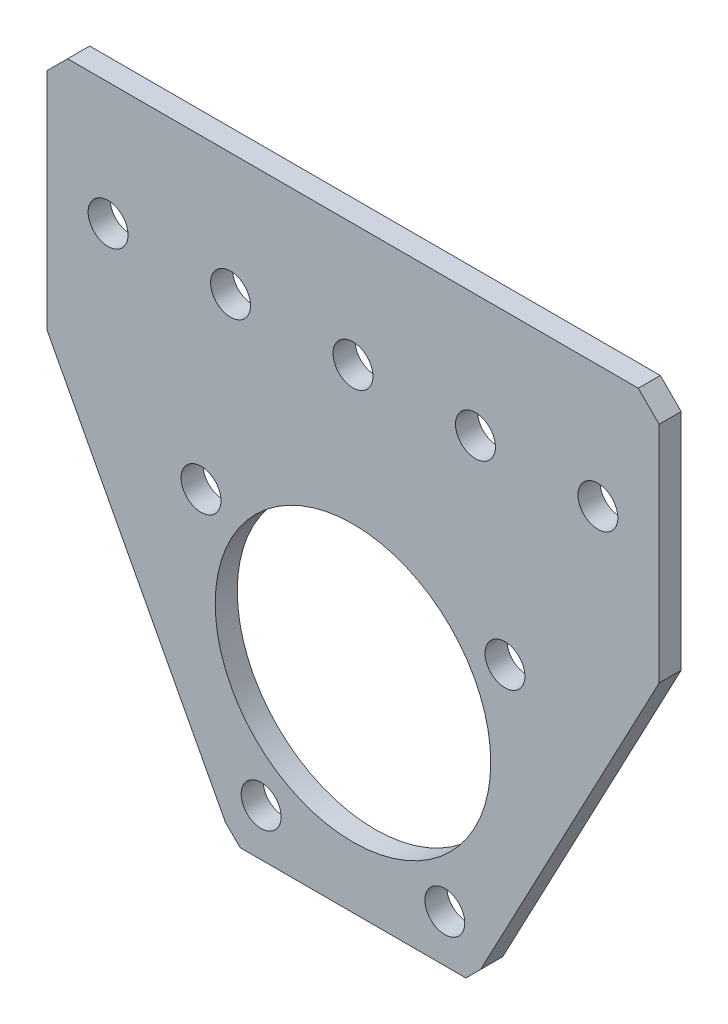
ISO-10303-21;
HEADER;
FILE_DESCRIPTION(('STEP AP214'),'2;1');
FILE_NAME('part.step','',(''),(''),'','','');
FILE_SCHEMA(('AUTOMOTIVE_DESIGN { 1 0 10303 214 1 1 1 1 }'));
ENDSEC;
DATA;
#1=APPLICATION_CONTEXT('core data for automotive mechanical design processes');
#2=APPLICATION_PROTOCOL_DEFINITION('international standard','automotive_design',2000,#1);
#3=PRODUCT_CONTEXT('',#1,'mechanical');
#4=PRODUCT('Part','Part','',(#3));
#5=PRODUCT_RELATED_PRODUCT_CATEGORY('part','',(#4));
#6=PRODUCT_DEFINITION_FORMATION('','',#4);
#7=PRODUCT_DEFINITION_CONTEXT('part definition',#1,'design');
#8=PRODUCT_DEFINITION('design','',#6,#7);
#9=PRODUCT_DEFINITION_SHAPE('','',#8);
#10=(LENGTH_UNIT() NAMED_UNIT(*) SI_UNIT(.MILLI.,.METRE.));
#11=(NAMED_UNIT(*) PLANE_ANGLE_UNIT() SI_UNIT($,.RADIAN.));
#12=(NAMED_UNIT(*) SI_UNIT($,.STERADIAN.) SOLID_ANGLE_UNIT());
#13=UNCERTAINTY_MEASURE_WITH_UNIT(LENGTH_MEASURE(1.E-05),#10,'distance_accuracy_value','');
#14=(GEOMETRIC_REPRESENTATION_CONTEXT(3) GLOBAL_UNCERTAINTY_ASSIGNED_CONTEXT((#13)) GLOBAL_UNIT_ASSIGNED_CONTEXT((#10,
#11,#12)) REPRESENTATION_CONTEXT('',''));
#15=CARTESIAN_POINT('',(0.,0.,0.));
#16=DIRECTION('',(0.,0.,1.));
#17=DIRECTION('',(1.,0.,0.));
#18=AXIS2_PLACEMENT_3D('',#15,#16,#17);
#19=CARTESIAN_POINT('',(-29.591,41.275,2.286));
#20=DIRECTION('',(0.,1.,0.));
#21=DIRECTION('',(-1.,0.,0.));
#22=AXIS2_PLACEMENT_3D('',#19,#20,#21);
#23=PLANE('',#22);
#24=DIRECTION('',(1.,0.,0.));
#25=VECTOR('',#24,1.);
#26=CARTESIAN_POINT('',(-29.591,41.275,0.));
#27=LINE('',#26,#25);
#28=CARTESIAN_POINT('',(-29.591,41.275,0.));
#29=VERTEX_POINT('',#28);
#30=CARTESIAN_POINT('',(29.591,41.275,0.));
#31=VERTEX_POINT('',#30);
#32=EDGE_CURVE('E142',#29,#31,#27,.T.);
#33=ORIENTED_EDGE('',*,*,#32,.F.);
#34=DIRECTION('',(0.,0.,-1.));
#35=VECTOR('',#34,1.);
#36=CARTESIAN_POINT('',(-29.591,41.275,2.286));
#37=LINE('',#36,#35);
#38=CARTESIAN_POINT('',(-29.591,41.275,2.286));
#39=VERTEX_POINT('',#38);
#40=EDGE_CURVE('E11',#39,#29,#37,.T.);
#41=ORIENTED_EDGE('',*,*,#40,.F.);
#42=DIRECTION('',(1.,0.,0.));
#43=VECTOR('',#42,1.);
#44=CARTESIAN_POINT('',(-29.591,41.275,2.286));
#45=LINE('',#44,#43);
#46=CARTESIAN_POINT('',(29.591,41.275,2.286));
#47=VERTEX_POINT('',#46);
#48=EDGE_CURVE('E169',#39,#47,#45,.T.);
#49=ORIENTED_EDGE('',*,*,#48,.T.);
#50=DIRECTION('',(0.,0.,-1.));
#51=VECTOR('',#50,1.);
#52=CARTESIAN_POINT('',(29.591,41.275,2.286));
#53=LINE('',#52,#51);
#54=EDGE_CURVE('E36',#47,#31,#53,.T.);
#55=ORIENTED_EDGE('',*,*,#54,.T.);
#56=EDGE_LOOP('',(#33,#41,#49,#55));
#57=FACE_BOUND('',#56,.T.);
#58=ADVANCED_FACE('F33',(#57),#23,.T.);
#59=CARTESIAN_POINT('',(-31.75,39.116,2.286));
#60=DIRECTION('',(-0.707106781186545,0.70710678118655,0.));
#61=DIRECTION('',(-0.70710678118655,-0.707106781186545,0.));
#62=AXIS2_PLACEMENT_3D('',#59,#60,#61);
#63=PLANE('',#62);
#64=DIRECTION('',(0.70710678118655,0.707106781186545,0.));
#65=VECTOR('',#64,1.);
#66=CARTESIAN_POINT('',(-31.75,39.116,0.));
#67=LINE('',#66,#65);
#68=CARTESIAN_POINT('',(-31.75,39.116,0.));
#69=VERTEX_POINT('',#68);
#70=EDGE_CURVE('E167',#69,#29,#67,.T.);
#71=ORIENTED_EDGE('',*,*,#70,.F.);
#72=DIRECTION('',(0.,0.,-1.));
#73=VECTOR('',#72,1.);
#74=CARTESIAN_POINT('',(-31.75,39.116,2.286));
#75=LINE('',#74,#73);
#76=CARTESIAN_POINT('',(-31.75,39.116,2.286));
#77=VERTEX_POINT('',#76);
#78=EDGE_CURVE('E42',#77,#69,#75,.T.);
#79=ORIENTED_EDGE('',*,*,#78,.F.);
#80=DIRECTION('',(0.70710678118655,0.707106781186545,0.));
#81=VECTOR('',#80,1.);
#82=CARTESIAN_POINT('',(-31.75,39.116,2.286));
#83=LINE('',#82,#81);
#84=EDGE_CURVE('E132',#77,#39,#83,.T.);
#85=ORIENTED_EDGE('',*,*,#84,.T.);
#86=ORIENTED_EDGE('',*,*,#40,.T.);
#87=EDGE_LOOP('',(#71,#79,#85,#86));
#88=FACE_BOUND('',#87,.T.);
#89=ADVANCED_FACE('F185',(#88),#63,.T.);
#90=CARTESIAN_POINT('',(-31.75,15.875,2.286));
#91=DIRECTION('',(-1.,0.,0.));
#92=DIRECTION('',(0.,-1.,0.));
#93=AXIS2_PLACEMENT_3D('',#90,#91,#92);
#94=PLANE('',#93);
#95=DIRECTION('',(0.,1.,0.));
#96=VECTOR('',#95,1.);
#97=CARTESIAN_POINT('',(-31.75,15.875,0.));
#98=LINE('',#97,#96);
#99=CARTESIAN_POINT('',(-31.75,15.875,0.));
#100=VERTEX_POINT('',#99);
#101=EDGE_CURVE('E119',#100,#69,#98,.T.);
#102=ORIENTED_EDGE('',*,*,#101,.F.);
#103=DIRECTION('',(0.,0.,-1.));
#104=VECTOR('',#103,1.);
#105=CARTESIAN_POINT('',(-31.75,15.875,2.286));
#106=LINE('',#105,#104);
#107=CARTESIAN_POINT('',(-31.75,15.875,2.286));
#108=VERTEX_POINT('',#107);
#109=EDGE_CURVE('E114',#108,#100,#106,.T.);
#110=ORIENTED_EDGE('',*,*,#109,.F.);
#111=DIRECTION('',(0.,1.,0.));
#112=VECTOR('',#111,1.);
#113=CARTESIAN_POINT('',(-31.75,15.875,2.286));
#114=LINE('',#113,#112);
#115=EDGE_CURVE('E117',#108,#77,#114,.T.);
#116=ORIENTED_EDGE('',*,*,#115,.T.);
#117=ORIENTED_EDGE('',*,*,#78,.T.);
#118=EDGE_LOOP('',(#102,#110,#116,#117));
#119=FACE_BOUND('',#118,.T.);
#120=ADVANCED_FACE('F116',(#119),#94,.T.);
#121=CARTESIAN_POINT('',(-13.2357534010395,-19.1108564594182,2.286));
#122=DIRECTION('',(-0.883868107973205,-0.46773621594641,0.));
#123=DIRECTION('',(0.46773621594641,-0.883868107973205,0.));
#124=AXIS2_PLACEMENT_3D('',#121,#122,#123);
#125=PLANE('',#124);
#126=DIRECTION('',(-0.46773621594641,0.883868107973205,0.));
#127=VECTOR('',#126,1.);
#128=CARTESIAN_POINT('',(-13.2357534010395,-19.1108564594182,0.));
#129=LINE('',#128,#127);
#130=CARTESIAN_POINT('',(-13.2357534010395,-19.1108564594182,0.));
#131=VERTEX_POINT('',#130);
#132=EDGE_CURVE('E164',#131,#100,#129,.T.);
#133=ORIENTED_EDGE('',*,*,#132,.F.);
#134=DIRECTION('',(0.,0.,-1.));
#135=VECTOR('',#134,1.);
#136=CARTESIAN_POINT('',(-13.2357534010395,-19.1108564594182,2.286));
#137=LINE('',#136,#135);
#138=CARTESIAN_POINT('',(-13.2357534010395,-19.1108564594182,2.286));
#139=VERTEX_POINT('',#138);
#140=EDGE_CURVE('E124',#139,#131,#137,.T.);
#141=ORIENTED_EDGE('',*,*,#140,.F.);
#142=DIRECTION('',(-0.46773621594641,0.883868107973205,0.));
#143=VECTOR('',#142,1.);
#144=CARTESIAN_POINT('',(-13.2357534010395,-19.1108564594182,2.286));
#145=LINE('',#144,#143);
#146=EDGE_CURVE('E130',#139,#108,#145,.T.);
#147=ORIENTED_EDGE('',*,*,#146,.T.);
#148=ORIENTED_EDGE('',*,*,#109,.T.);
#149=EDGE_LOOP('',(#133,#141,#147,#148));
#150=FACE_BOUND('',#149,.T.);
#151=ADVANCED_FACE('F134',(#150),#125,.T.);
#152=CARTESIAN_POINT('',(-11.7091098604578,-20.6375,2.286));
#153=DIRECTION('',(-0.70710678118655,-0.707106781186545,0.));
#154=DIRECTION('',(0.707106781186545,-0.70710678118655,0.));
#155=AXIS2_PLACEMENT_3D('',#152,#153,#154);
#156=PLANE('',#155);
#157=DIRECTION('',(-0.707106781186545,0.70710678118655,0.));
#158=VECTOR('',#157,1.);
#159=CARTESIAN_POINT('',(-11.7091098604578,-20.6375,0.));
#160=LINE('',#159,#158);
#161=CARTESIAN_POINT('',(-11.7091098604578,-20.6375,0.));
#162=VERTEX_POINT('',#161);
#163=EDGE_CURVE('E161',#162,#131,#160,.T.);
#164=ORIENTED_EDGE('',*,*,#163,.F.);
#165=DIRECTION('',(0.,0.,-1.));
#166=VECTOR('',#165,1.);
#167=CARTESIAN_POINT('',(-11.7091098604578,-20.6375,2.286));
#168=LINE('',#167,#166);
#169=CARTESIAN_POINT('',(-11.7091098604578,-20.6375,2.286));
#170=VERTEX_POINT('',#169);
#171=EDGE_CURVE('E173',#170,#162,#168,.T.);
#172=ORIENTED_EDGE('',*,*,#171,.F.);
#173=DIRECTION('',(-0.707106781186545,0.70710678118655,0.));
#174=VECTOR('',#173,1.);
#175=CARTESIAN_POINT('',(-11.7091098604578,-20.6375,2.286));
#176=LINE('',#175,#174);
#177=EDGE_CURVE('E135',#170,#139,#176,.T.);
#178=ORIENTED_EDGE('',*,*,#177,.T.);
#179=ORIENTED_EDGE('',*,*,#140,.T.);
#180=EDGE_LOOP('',(#164,#172,#178,#179));
#181=FACE_BOUND('',#180,.T.);
#182=ADVANCED_FACE('F198',(#181),#156,.T.);
#183=CARTESIAN_POINT('',(11.7091098604577,-20.6375,2.286));
#184=DIRECTION('',(0.,-1.,0.));
#185=DIRECTION('',(1.,0.,0.));
#186=AXIS2_PLACEMENT_3D('',#183,#184,#185);
#187=PLANE('',#186);
#188=DIRECTION('',(-1.,0.,0.));
#189=VECTOR('',#188,1.);
#190=CARTESIAN_POINT('',(11.7091098604577,-20.6375,0.));
#191=LINE('',#190,#189);
#192=CARTESIAN_POINT('',(11.7091098604577,-20.6375,0.));
#193=VERTEX_POINT('',#192);
#194=EDGE_CURVE('E158',#193,#162,#191,.T.);
#195=ORIENTED_EDGE('',*,*,#194,.F.);
#196=DIRECTION('',(0.,0.,-1.));
#197=VECTOR('',#196,1.);
#198=CARTESIAN_POINT('',(11.7091098604577,-20.6375,2.286));
#199=LINE('',#198,#197);
#200=CARTESIAN_POINT('',(11.7091098604577,-20.6375,2.286));
#201=VERTEX_POINT('',#200);
#202=EDGE_CURVE('E175',#201,#193,#199,.T.);
#203=ORIENTED_EDGE('',*,*,#202,.F.);
#204=DIRECTION('',(-1.,0.,0.));
#205=VECTOR('',#204,1.);
#206=CARTESIAN_POINT('',(11.7091098604577,-20.6375,2.286));
#207=LINE('',#206,#205);
#208=EDGE_CURVE('E137',#201,#170,#207,.T.);
#209=ORIENTED_EDGE('',*,*,#208,.T.);
#210=ORIENTED_EDGE('',*,*,#171,.T.);
#211=EDGE_LOOP('',(#195,#203,#209,#210));
#212=FACE_BOUND('',#211,.T.);
#213=ADVANCED_FACE('F201',(#212),#187,.T.);
#214=CARTESIAN_POINT('',(13.2357534010395,-19.1108564594182,2.286));
#215=DIRECTION('',(0.707106781186546,-0.70710678118655,0.));
#216=DIRECTION('',(0.70710678118655,0.707106781186546,0.));
#217=AXIS2_PLACEMENT_3D('',#214,#215,#216);
#218=PLANE('',#217);
#219=DIRECTION('',(-0.707106781186549,-0.707106781186545,0.));
#220=VECTOR('',#219,1.);
#221=CARTESIAN_POINT('',(13.2357534010395,-19.1108564594182,0.));
#222=LINE('',#221,#220);
#223=CARTESIAN_POINT('',(13.2357534010395,-19.1108564594182,0.));
#224=VERTEX_POINT('',#223);
#225=EDGE_CURVE('E155',#224,#193,#222,.T.);
#226=ORIENTED_EDGE('',*,*,#225,.F.);
#227=DIRECTION('',(0.,0.,-1.));
#228=VECTOR('',#227,1.);
#229=CARTESIAN_POINT('',(13.2357534010395,-19.1108564594182,2.286));
#230=LINE('',#229,#228);
#231=CARTESIAN_POINT('',(13.2357534010395,-19.1108564594182,2.286));
#232=VERTEX_POINT('',#231);
#233=EDGE_CURVE('E177',#232,#224,#230,.T.);
#234=ORIENTED_EDGE('',*,*,#233,.F.);
#235=DIRECTION('',(-0.707106781186549,-0.707106781186545,0.));
#236=VECTOR('',#235,1.);
#237=CARTESIAN_POINT('',(13.2357534010395,-19.1108564594182,2.286));
#238=LINE('',#237,#236);
#239=EDGE_CURVE('E341',#232,#201,#238,.T.);
#240=ORIENTED_EDGE('',*,*,#239,.T.);
#241=ORIENTED_EDGE('',*,*,#202,.T.);
#242=EDGE_LOOP('',(#226,#234,#240,#241));
#243=FACE_BOUND('',#242,.T.);
#244=ADVANCED_FACE('F205',(#243),#218,.T.);
#245=CARTESIAN_POINT('',(31.75,15.875,2.286));
#246=DIRECTION('',(0.883868107973205,-0.46773621594641,0.));
#247=DIRECTION('',(0.46773621594641,0.883868107973205,0.));
#248=AXIS2_PLACEMENT_3D('',#245,#246,#247);
#249=PLANE('',#248);
#250=DIRECTION('',(-0.46773621594641,-0.883868107973205,0.));
#251=VECTOR('',#250,1.);
#252=CARTESIAN_POINT('',(31.75,15.875,0.));
#253=LINE('',#252,#251);
#254=CARTESIAN_POINT('',(31.75,15.875,0.));
#255=VERTEX_POINT('',#254);
#256=EDGE_CURVE('E152',#255,#224,#253,.T.);
#257=ORIENTED_EDGE('',*,*,#256,.F.);
#258=DIRECTION('',(0.,0.,-1.));
#259=VECTOR('',#258,1.);
#260=CARTESIAN_POINT('',(31.75,15.875,2.286));
#261=LINE('',#260,#259);
#262=CARTESIAN_POINT('',(31.75,15.875,2.286));
#263=VERTEX_POINT('',#262);
#264=EDGE_CURVE('E179',#263,#255,#261,.T.);
#265=ORIENTED_EDGE('',*,*,#264,.F.);
#266=DIRECTION('',(-0.46773621594641,-0.883868107973205,0.));
#267=VECTOR('',#266,1.);
#268=CARTESIAN_POINT('',(31.75,15.875,2.286));
#269=LINE('',#268,#267);
#270=EDGE_CURVE('E338',#263,#232,#269,.T.);
#271=ORIENTED_EDGE('',*,*,#270,.T.);
#272=ORIENTED_EDGE('',*,*,#233,.T.);
#273=EDGE_LOOP('',(#257,#265,#271,#272));
#274=FACE_BOUND('',#273,.T.);
#275=ADVANCED_FACE('F209',(#274),#249,.T.);
#276=CARTESIAN_POINT('',(31.75,39.116,2.286));
#277=DIRECTION('',(1.,0.,0.));
#278=DIRECTION('',(0.,0.,-1.));
#279=AXIS2_PLACEMENT_3D('',#276,#277,#278);
#280=PLANE('',#279);
#281=DIRECTION('',(0.,-1.,0.));
#282=VECTOR('',#281,1.);
#283=CARTESIAN_POINT('',(31.75,39.116,0.));
#284=LINE('',#283,#282);
#285=CARTESIAN_POINT('',(31.75,39.116,0.));
#286=VERTEX_POINT('',#285);
#287=EDGE_CURVE('E149',#286,#255,#284,.T.);
#288=ORIENTED_EDGE('',*,*,#287,.F.);
#289=DIRECTION('',(0.,0.,-1.));
#290=VECTOR('',#289,1.);
#291=CARTESIAN_POINT('',(31.75,39.116,2.286));
#292=LINE('',#291,#290);
#293=CARTESIAN_POINT('',(31.75,39.116,2.286));
#294=VERTEX_POINT('',#293);
#295=EDGE_CURVE('E180',#294,#286,#292,.T.);
#296=ORIENTED_EDGE('',*,*,#295,.F.);
#297=DIRECTION('',(0.,-1.,0.));
#298=VECTOR('',#297,1.);
#299=CARTESIAN_POINT('',(31.75,39.116,2.286));
#300=LINE('',#299,#298);
#301=EDGE_CURVE('E335',#294,#263,#300,.T.);
#302=ORIENTED_EDGE('',*,*,#301,.T.);
#303=ORIENTED_EDGE('',*,*,#264,.T.);
#304=EDGE_LOOP('',(#288,#296,#302,#303));
#305=FACE_BOUND('',#304,.T.);
#306=ADVANCED_FACE('F213',(#305),#280,.T.);
#307=CARTESIAN_POINT('',(29.591,41.275,2.286));
#308=DIRECTION('',(0.707106781186546,0.707106781186549,0.));
#309=DIRECTION('',(-0.707106781186549,0.707106781186546,0.));
#310=AXIS2_PLACEMENT_3D('',#307,#308,#309);
#311=PLANE('',#310);
#312=DIRECTION('',(0.707106781186549,-0.707106781186546,0.));
#313=VECTOR('',#312,1.);
#314=CARTESIAN_POINT('',(29.591,41.275,0.));
#315=LINE('',#314,#313);
#316=EDGE_CURVE('E145',#31,#286,#315,.T.);
#317=ORIENTED_EDGE('',*,*,#316,.F.);
#318=ORIENTED_EDGE('',*,*,#54,.F.);
#319=DIRECTION('',(0.707106781186549,-0.707106781186546,0.));
#320=VECTOR('',#319,1.);
#321=CARTESIAN_POINT('',(29.591,41.275,2.286));
#322=LINE('',#321,#320);
#323=EDGE_CURVE('E333',#47,#294,#322,.T.);
#324=ORIENTED_EDGE('',*,*,#323,.T.);
#325=ORIENTED_EDGE('',*,*,#295,.T.);
#326=EDGE_LOOP('',(#317,#318,#324,#325));
#327=FACE_BOUND('',#326,.T.);
#328=ADVANCED_FACE('F182',(#327),#311,.T.);
#329=CARTESIAN_POINT('',(0.,0.,2.286));
#330=DIRECTION('',(0.,0.,-1.));
#331=DIRECTION('',(-1.,0.,0.));
#332=AXIS2_PLACEMENT_3D('',#329,#330,#331);
#333=PLANE('',#332);
#334=CARTESIAN_POINT('',(9.525,-15.7602855304084,2.286));
#335=DIRECTION('',(0.,0.,-1.));
#336=DIRECTION('',(1.,0.,0.));
#337=AXIS2_PLACEMENT_3D('',#334,#335,#336);
#338=CIRCLE('',#337,2.0701);
#339=CARTESIAN_POINT('',(11.5951,-15.7602855304084,2.286));
#340=VERTEX_POINT('',#339);
#341=EDGE_CURVE('E272',#340,#340,#338,.T.);
#342=ORIENTED_EDGE('',*,*,#341,.T.);
#343=EDGE_LOOP('',(#342));
#344=FACE_BOUND('',#343,.T.);
#345=CARTESIAN_POINT('',(-15.7602855304084,9.525,2.286));
#346=DIRECTION('',(0.,0.,-1.));
#347=DIRECTION('',(1.,0.,0.));
#348=AXIS2_PLACEMENT_3D('',#345,#346,#347);
#349=CIRCLE('',#348,2.0701);
#350=CARTESIAN_POINT('',(-13.6901855304084,9.525,2.286));
#351=VERTEX_POINT('',#350);
#352=EDGE_CURVE('E280',#351,#351,#349,.T.);
#353=ORIENTED_EDGE('',*,*,#352,.T.);
#354=EDGE_LOOP('',(#353));
#355=FACE_BOUND('',#354,.T.);
#356=CARTESIAN_POINT('',(0.,28.575,2.286));
#357=DIRECTION('',(0.,0.,-1.));
#358=DIRECTION('',(1.,0.,0.));
#359=AXIS2_PLACEMENT_3D('',#356,#357,#358);
#360=CIRCLE('',#359,2.0701);
#361=CARTESIAN_POINT('',(2.07009999999999,28.575,2.286));
#362=VERTEX_POINT('',#361);
#363=EDGE_CURVE('E286',#362,#362,#360,.T.);
#364=ORIENTED_EDGE('',*,*,#363,.T.);
#365=EDGE_LOOP('',(#364));
#366=FACE_BOUND('',#365,.T.);
#367=CARTESIAN_POINT('',(25.4,28.575,2.286));
#368=DIRECTION('',(0.,0.,-1.));
#369=DIRECTION('',(1.,0.,0.));
#370=AXIS2_PLACEMENT_3D('',#367,#368,#369);
#371=CIRCLE('',#370,2.0701);
#372=CARTESIAN_POINT('',(27.4701,28.575,2.286));
#373=VERTEX_POINT('',#372);
#374=EDGE_CURVE('E292',#373,#373,#371,.T.);
#375=ORIENTED_EDGE('',*,*,#374,.T.);
#376=EDGE_LOOP('',(#375));
#377=FACE_BOUND('',#376,.T.);
#378=CARTESIAN_POINT('',(0.,0.,2.286));
#379=DIRECTION('',(0.,0.,-1.));
#380=DIRECTION('',(1.,0.,0.));
#381=AXIS2_PLACEMENT_3D('',#378,#379,#380);
#382=CIRCLE('',#381,14.2875);
#383=CARTESIAN_POINT('',(14.2875,0.,2.286));
#384=VERTEX_POINT('',#383);
#385=EDGE_CURVE('E298',#384,#384,#382,.T.);
#386=ORIENTED_EDGE('',*,*,#385,.T.);
#387=EDGE_LOOP('',(#386));
#388=FACE_BOUND('',#387,.T.);
#389=CARTESIAN_POINT('',(-25.4,28.575,2.286));
#390=DIRECTION('',(0.,0.,-1.));
#391=DIRECTION('',(1.,0.,0.));
#392=AXIS2_PLACEMENT_3D('',#389,#390,#391);
#393=CIRCLE('',#392,2.0701);
#394=CARTESIAN_POINT('',(-23.3299,28.575,2.286));
#395=VERTEX_POINT('',#394);
#396=EDGE_CURVE('E304',#395,#395,#393,.T.);
#397=ORIENTED_EDGE('',*,*,#396,.T.);
#398=EDGE_LOOP('',(#397));
#399=FACE_BOUND('',#398,.T.);
#400=CARTESIAN_POINT('',(-12.7,28.575,2.286));
#401=DIRECTION('',(0.,0.,-1.));
#402=DIRECTION('',(1.,0.,0.));
#403=AXIS2_PLACEMENT_3D('',#400,#401,#402);
#404=CIRCLE('',#403,2.0701);
#405=CARTESIAN_POINT('',(-10.6299,28.575,2.286));
#406=VERTEX_POINT('',#405);
#407=EDGE_CURVE('E310',#406,#406,#404,.T.);
#408=ORIENTED_EDGE('',*,*,#407,.T.);
#409=EDGE_LOOP('',(#408));
#410=FACE_BOUND('',#409,.T.);
#411=CARTESIAN_POINT('',(12.7,28.575,2.286));
#412=DIRECTION('',(0.,0.,-1.));
#413=DIRECTION('',(1.,0.,0.));
#414=AXIS2_PLACEMENT_3D('',#411,#412,#413);
#415=CIRCLE('',#414,2.0701);
#416=CARTESIAN_POINT('',(14.7701,28.575,2.286));
#417=VERTEX_POINT('',#416);
#418=EDGE_CURVE('E316',#417,#417,#415,.T.);
#419=ORIENTED_EDGE('',*,*,#418,.T.);
#420=EDGE_LOOP('',(#419));
#421=FACE_BOUND('',#420,.T.);
#422=CARTESIAN_POINT('',(-9.525,-15.7602855304084,2.286));
#423=DIRECTION('',(0.,0.,-1.));
#424=DIRECTION('',(1.,0.,0.));
#425=AXIS2_PLACEMENT_3D('',#422,#423,#424);
#426=CIRCLE('',#425,2.0701);
#427=CARTESIAN_POINT('',(-7.4549,-15.7602855304084,2.286));
#428=VERTEX_POINT('',#427);
#429=EDGE_CURVE('E322',#428,#428,#426,.T.);
#430=ORIENTED_EDGE('',*,*,#429,.T.);
#431=EDGE_LOOP('',(#430));
#432=FACE_BOUND('',#431,.T.);
#433=CARTESIAN_POINT('',(15.7602855304084,9.525,2.286));
#434=DIRECTION('',(0.,0.,-1.));
#435=DIRECTION('',(1.,0.,0.));
#436=AXIS2_PLACEMENT_3D('',#433,#434,#435);
#437=CIRCLE('',#436,2.0701);
#438=CARTESIAN_POINT('',(17.8303855304084,9.525,2.286));
#439=VERTEX_POINT('',#438);
#440=EDGE_CURVE('E146',#439,#439,#437,.T.);
#441=ORIENTED_EDGE('',*,*,#440,.T.);
#442=EDGE_LOOP('',(#441));
#443=FACE_BOUND('',#442,.T.);
#444=ORIENTED_EDGE('',*,*,#48,.F.);
#445=ORIENTED_EDGE('',*,*,#84,.F.);
#446=ORIENTED_EDGE('',*,*,#115,.F.);
#447=ORIENTED_EDGE('',*,*,#146,.F.);
#448=ORIENTED_EDGE('',*,*,#177,.F.);
#449=ORIENTED_EDGE('',*,*,#208,.F.);
#450=ORIENTED_EDGE('',*,*,#239,.F.);
#451=ORIENTED_EDGE('',*,*,#270,.F.);
#452=ORIENTED_EDGE('',*,*,#301,.F.);
#453=ORIENTED_EDGE('',*,*,#323,.F.);
#454=EDGE_LOOP('',(#444,#445,#446,#447,#448,#449,#450,#451,#452,#453));
#455=FACE_BOUND('',#454,.T.);
#456=ADVANCED_FACE('F128',(#344,#355,#366,#377,#388,#399,#410,#421,#432,#443,#455),#333,.F.);
#457=CARTESIAN_POINT('',(0.,0.,0.));
#458=DIRECTION('',(0.,0.,-1.));
#459=DIRECTION('',(-1.,0.,0.));
#460=AXIS2_PLACEMENT_3D('',#457,#458,#459);
#461=PLANE('',#460);
#462=CARTESIAN_POINT('',(9.525,-15.7602855304084,0.));
#463=DIRECTION('',(0.,0.,-1.));
#464=DIRECTION('',(1.,0.,0.));
#465=AXIS2_PLACEMENT_3D('',#462,#463,#464);
#466=CIRCLE('',#465,2.0701);
#467=CARTESIAN_POINT('',(11.5951,-15.7602855304084,0.));
#468=VERTEX_POINT('',#467);
#469=EDGE_CURVE('E275',#468,#468,#466,.T.);
#470=ORIENTED_EDGE('',*,*,#469,.F.);
#471=EDGE_LOOP('',(#470));
#472=FACE_BOUND('',#471,.T.);
#473=CARTESIAN_POINT('',(-15.7602855304084,9.525,0.));
#474=DIRECTION('',(0.,0.,-1.));
#475=DIRECTION('',(1.,0.,0.));
#476=AXIS2_PLACEMENT_3D('',#473,#474,#475);
#477=CIRCLE('',#476,2.0701);
#478=CARTESIAN_POINT('',(-13.6901855304084,9.525,0.));
#479=VERTEX_POINT('',#478);
#480=EDGE_CURVE('E277',#479,#479,#477,.T.);
#481=ORIENTED_EDGE('',*,*,#480,.F.);
#482=EDGE_LOOP('',(#481));
#483=FACE_BOUND('',#482,.T.);
#484=CARTESIAN_POINT('',(0.,28.575,0.));
#485=DIRECTION('',(0.,0.,-1.));
#486=DIRECTION('',(1.,0.,0.));
#487=AXIS2_PLACEMENT_3D('',#484,#485,#486);
#488=CIRCLE('',#487,2.0701);
#489=CARTESIAN_POINT('',(2.07009999999999,28.575,0.));
#490=VERTEX_POINT('',#489);
#491=EDGE_CURVE('E283',#490,#490,#488,.T.);
#492=ORIENTED_EDGE('',*,*,#491,.F.);
#493=EDGE_LOOP('',(#492));
#494=FACE_BOUND('',#493,.T.);
#495=CARTESIAN_POINT('',(25.4,28.575,0.));
#496=DIRECTION('',(0.,0.,-1.));
#497=DIRECTION('',(1.,0.,0.));
#498=AXIS2_PLACEMENT_3D('',#495,#496,#497);
#499=CIRCLE('',#498,2.0701);
#500=CARTESIAN_POINT('',(27.4701,28.575,0.));
#501=VERTEX_POINT('',#500);
#502=EDGE_CURVE('E289',#501,#501,#499,.T.);
#503=ORIENTED_EDGE('',*,*,#502,.F.);
#504=EDGE_LOOP('',(#503));
#505=FACE_BOUND('',#504,.T.);
#506=CARTESIAN_POINT('',(0.,0.,0.));
#507=DIRECTION('',(0.,0.,-1.));
#508=DIRECTION('',(1.,0.,0.));
#509=AXIS2_PLACEMENT_3D('',#506,#507,#508);
#510=CIRCLE('',#509,14.2875);
#511=CARTESIAN_POINT('',(14.2875,0.,0.));
#512=VERTEX_POINT('',#511);
#513=EDGE_CURVE('E295',#512,#512,#510,.T.);
#514=ORIENTED_EDGE('',*,*,#513,.F.);
#515=EDGE_LOOP('',(#514));
#516=FACE_BOUND('',#515,.T.);
#517=CARTESIAN_POINT('',(-25.4,28.575,0.));
#518=DIRECTION('',(0.,0.,-1.));
#519=DIRECTION('',(1.,0.,0.));
#520=AXIS2_PLACEMENT_3D('',#517,#518,#519);
#521=CIRCLE('',#520,2.0701);
#522=CARTESIAN_POINT('',(-23.3299,28.575,0.));
#523=VERTEX_POINT('',#522);
#524=EDGE_CURVE('E301',#523,#523,#521,.T.);
#525=ORIENTED_EDGE('',*,*,#524,.F.);
#526=EDGE_LOOP('',(#525));
#527=FACE_BOUND('',#526,.T.);
#528=CARTESIAN_POINT('',(-12.7,28.575,0.));
#529=DIRECTION('',(0.,0.,-1.));
#530=DIRECTION('',(1.,0.,0.));
#531=AXIS2_PLACEMENT_3D('',#528,#529,#530);
#532=CIRCLE('',#531,2.0701);
#533=CARTESIAN_POINT('',(-10.6299,28.575,0.));
#534=VERTEX_POINT('',#533);
#535=EDGE_CURVE('E307',#534,#534,#532,.T.);
#536=ORIENTED_EDGE('',*,*,#535,.F.);
#537=EDGE_LOOP('',(#536));
#538=FACE_BOUND('',#537,.T.);
#539=CARTESIAN_POINT('',(12.7,28.575,0.));
#540=DIRECTION('',(0.,0.,-1.));
#541=DIRECTION('',(1.,0.,0.));
#542=AXIS2_PLACEMENT_3D('',#539,#540,#541);
#543=CIRCLE('',#542,2.0701);
#544=CARTESIAN_POINT('',(14.7701,28.575,0.));
#545=VERTEX_POINT('',#544);
#546=EDGE_CURVE('E313',#545,#545,#543,.T.);
#547=ORIENTED_EDGE('',*,*,#546,.F.);
#548=EDGE_LOOP('',(#547));
#549=FACE_BOUND('',#548,.T.);
#550=CARTESIAN_POINT('',(-9.525,-15.7602855304084,0.));
#551=DIRECTION('',(0.,0.,-1.));
#552=DIRECTION('',(1.,0.,0.));
#553=AXIS2_PLACEMENT_3D('',#550,#551,#552);
#554=CIRCLE('',#553,2.0701);
#555=CARTESIAN_POINT('',(-7.4549,-15.7602855304084,0.));
#556=VERTEX_POINT('',#555);
#557=EDGE_CURVE('E319',#556,#556,#554,.T.);
#558=ORIENTED_EDGE('',*,*,#557,.F.);
#559=EDGE_LOOP('',(#558));
#560=FACE_BOUND('',#559,.T.);
#561=CARTESIAN_POINT('',(15.7602855304084,9.525,0.));
#562=DIRECTION('',(0.,0.,-1.));
#563=DIRECTION('',(1.,0.,0.));
#564=AXIS2_PLACEMENT_3D('',#561,#562,#563);
#565=CIRCLE('',#564,2.0701);
#566=CARTESIAN_POINT('',(17.8303855304084,9.525,0.));
#567=VERTEX_POINT('',#566);
#568=EDGE_CURVE('E325',#567,#567,#565,.T.);
#569=ORIENTED_EDGE('',*,*,#568,.F.);
#570=EDGE_LOOP('',(#569));
#571=FACE_BOUND('',#570,.T.);
#572=ORIENTED_EDGE('',*,*,#32,.T.);
#573=ORIENTED_EDGE('',*,*,#316,.T.);
#574=ORIENTED_EDGE('',*,*,#287,.T.);
#575=ORIENTED_EDGE('',*,*,#256,.T.);
#576=ORIENTED_EDGE('',*,*,#225,.T.);
#577=ORIENTED_EDGE('',*,*,#194,.T.);
#578=ORIENTED_EDGE('',*,*,#163,.T.);
#579=ORIENTED_EDGE('',*,*,#132,.T.);
#580=ORIENTED_EDGE('',*,*,#101,.T.);
#581=ORIENTED_EDGE('',*,*,#70,.T.);
#582=EDGE_LOOP('',(#572,#573,#574,#575,#576,#577,#578,#579,#580,#581));
#583=FACE_BOUND('',#582,.T.);
#584=ADVANCED_FACE('F184',(#472,#483,#494,#505,#516,#527,#538,#549,#560,#571,#583),#461,.T.);
#585=CARTESIAN_POINT('',(15.7602855304084,9.525,2.286));
#586=DIRECTION('',(0.,0.,-1.));
#587=DIRECTION('',(-1.,0.,0.));
#588=AXIS2_PLACEMENT_3D('',#585,#586,#587);
#589=CYLINDRICAL_SURFACE('',#588,2.0701);
#590=ORIENTED_EDGE('',*,*,#440,.F.);
#591=EDGE_LOOP('',(#590));
#592=FACE_BOUND('',#591,.T.);
#593=ORIENTED_EDGE('',*,*,#568,.T.);
#594=EDGE_LOOP('',(#593));
#595=FACE_BOUND('',#594,.T.);
#596=ADVANCED_FACE('F225',(#592,#595),#589,.F.);
#597=CARTESIAN_POINT('',(-9.525,-15.7602855304084,2.286));
#598=DIRECTION('',(0.,0.,-1.));
#599=DIRECTION('',(-1.,0.,0.));
#600=AXIS2_PLACEMENT_3D('',#597,#598,#599);
#601=CYLINDRICAL_SURFACE('',#600,2.0701);
#602=ORIENTED_EDGE('',*,*,#429,.F.);
#603=EDGE_LOOP('',(#602));
#604=FACE_BOUND('',#603,.T.);
#605=ORIENTED_EDGE('',*,*,#557,.T.);
#606=EDGE_LOOP('',(#605));
#607=FACE_BOUND('',#606,.T.);
#608=ADVANCED_FACE('F232',(#604,#607),#601,.F.);
#609=CARTESIAN_POINT('',(12.7,28.575,2.286));
#610=DIRECTION('',(0.,0.,-1.));
#611=DIRECTION('',(-1.,0.,0.));
#612=AXIS2_PLACEMENT_3D('',#609,#610,#611);
#613=CYLINDRICAL_SURFACE('',#612,2.0701);
#614=ORIENTED_EDGE('',*,*,#418,.F.);
#615=EDGE_LOOP('',(#614));
#616=FACE_BOUND('',#615,.T.);
#617=ORIENTED_EDGE('',*,*,#546,.T.);
#618=EDGE_LOOP('',(#617));
#619=FACE_BOUND('',#618,.T.);
#620=ADVANCED_FACE('F236',(#616,#619),#613,.F.);
#621=CARTESIAN_POINT('',(-12.7,28.575,2.286));
#622=DIRECTION('',(0.,0.,-1.));
#623=DIRECTION('',(-1.,0.,0.));
#624=AXIS2_PLACEMENT_3D('',#621,#622,#623);
#625=CYLINDRICAL_SURFACE('',#624,2.0701);
#626=ORIENTED_EDGE('',*,*,#407,.F.);
#627=EDGE_LOOP('',(#626));
#628=FACE_BOUND('',#627,.T.);
#629=ORIENTED_EDGE('',*,*,#535,.T.);
#630=EDGE_LOOP('',(#629));
#631=FACE_BOUND('',#630,.T.);
#632=ADVANCED_FACE('F240',(#628,#631),#625,.F.);
#633=CARTESIAN_POINT('',(-25.4,28.575,2.286));
#634=DIRECTION('',(0.,0.,-1.));
#635=DIRECTION('',(-1.,0.,0.));
#636=AXIS2_PLACEMENT_3D('',#633,#634,#635);
#637=CYLINDRICAL_SURFACE('',#636,2.0701);
#638=ORIENTED_EDGE('',*,*,#396,.F.);
#639=EDGE_LOOP('',(#638));
#640=FACE_BOUND('',#639,.T.);
#641=ORIENTED_EDGE('',*,*,#524,.T.);
#642=EDGE_LOOP('',(#641));
#643=FACE_BOUND('',#642,.T.);
#644=ADVANCED_FACE('F244',(#640,#643),#637,.F.);
#645=CARTESIAN_POINT('',(0.,0.,2.286));
#646=DIRECTION('',(0.,0.,-1.));
#647=DIRECTION('',(-1.,0.,0.));
#648=AXIS2_PLACEMENT_3D('',#645,#646,#647);
#649=CYLINDRICAL_SURFACE('',#648,14.2875);
#650=ORIENTED_EDGE('',*,*,#385,.F.);
#651=EDGE_LOOP('',(#650));
#652=FACE_BOUND('',#651,.T.);
#653=ORIENTED_EDGE('',*,*,#513,.T.);
#654=EDGE_LOOP('',(#653));
#655=FACE_BOUND('',#654,.T.);
#656=ADVANCED_FACE('F248',(#652,#655),#649,.F.);
#657=CARTESIAN_POINT('',(25.4,28.575,2.286));
#658=DIRECTION('',(0.,0.,-1.));
#659=DIRECTION('',(-1.,0.,0.));
#660=AXIS2_PLACEMENT_3D('',#657,#658,#659);
#661=CYLINDRICAL_SURFACE('',#660,2.0701);
#662=ORIENTED_EDGE('',*,*,#374,.F.);
#663=EDGE_LOOP('',(#662));
#664=FACE_BOUND('',#663,.T.);
#665=ORIENTED_EDGE('',*,*,#502,.T.);
#666=EDGE_LOOP('',(#665));
#667=FACE_BOUND('',#666,.T.);
#668=ADVANCED_FACE('F252',(#664,#667),#661,.F.);
#669=CARTESIAN_POINT('',(0.,28.575,2.286));
#670=DIRECTION('',(0.,0.,-1.));
#671=DIRECTION('',(-1.,0.,0.));
#672=AXIS2_PLACEMENT_3D('',#669,#670,#671);
#673=CYLINDRICAL_SURFACE('',#672,2.0701);
#674=ORIENTED_EDGE('',*,*,#363,.F.);
#675=EDGE_LOOP('',(#674));
#676=FACE_BOUND('',#675,.T.);
#677=ORIENTED_EDGE('',*,*,#491,.T.);
#678=EDGE_LOOP('',(#677));
#679=FACE_BOUND('',#678,.T.);
#680=ADVANCED_FACE('F256',(#676,#679),#673,.F.);
#681=CARTESIAN_POINT('',(-15.7602855304084,9.525,2.286));
#682=DIRECTION('',(0.,0.,-1.));
#683=DIRECTION('',(-1.,0.,0.));
#684=AXIS2_PLACEMENT_3D('',#681,#682,#683);
#685=CYLINDRICAL_SURFACE('',#684,2.0701);
#686=ORIENTED_EDGE('',*,*,#352,.F.);
#687=EDGE_LOOP('',(#686));
#688=FACE_BOUND('',#687,.T.);
#689=ORIENTED_EDGE('',*,*,#480,.T.);
#690=EDGE_LOOP('',(#689));
#691=FACE_BOUND('',#690,.T.);
#692=ADVANCED_FACE('F260',(#688,#691),#685,.F.);
#693=CARTESIAN_POINT('',(9.525,-15.7602855304084,2.286));
#694=DIRECTION('',(0.,0.,-1.));
#695=DIRECTION('',(-1.,0.,0.));
#696=AXIS2_PLACEMENT_3D('',#693,#694,#695);
#697=CYLINDRICAL_SURFACE('',#696,2.0701);
#698=ORIENTED_EDGE('',*,*,#341,.F.);
#699=EDGE_LOOP('',(#698));
#700=FACE_BOUND('',#699,.T.);
#701=ORIENTED_EDGE('',*,*,#469,.T.);
#702=EDGE_LOOP('',(#701));
#703=FACE_BOUND('',#702,.T.);
#704=ADVANCED_FACE('F264',(#700,#703),#697,.F.);
#705=CLOSED_SHELL('',(#58,#89,#120,#151,#182,#213,#244,#275,#306,#328,#456,#584,#596,#608,#620,
#632,#644,#656,#668,#680,#692,#704));
#706=MANIFOLD_SOLID_BREP('B2',#705);
#707=ADVANCED_BREP_SHAPE_REPRESENTATION('',(#18,#706),#14);
#708=SHAPE_DEFINITION_REPRESENTATION(#9,#707);
ENDSEC;
END-ISO-10303-21;
